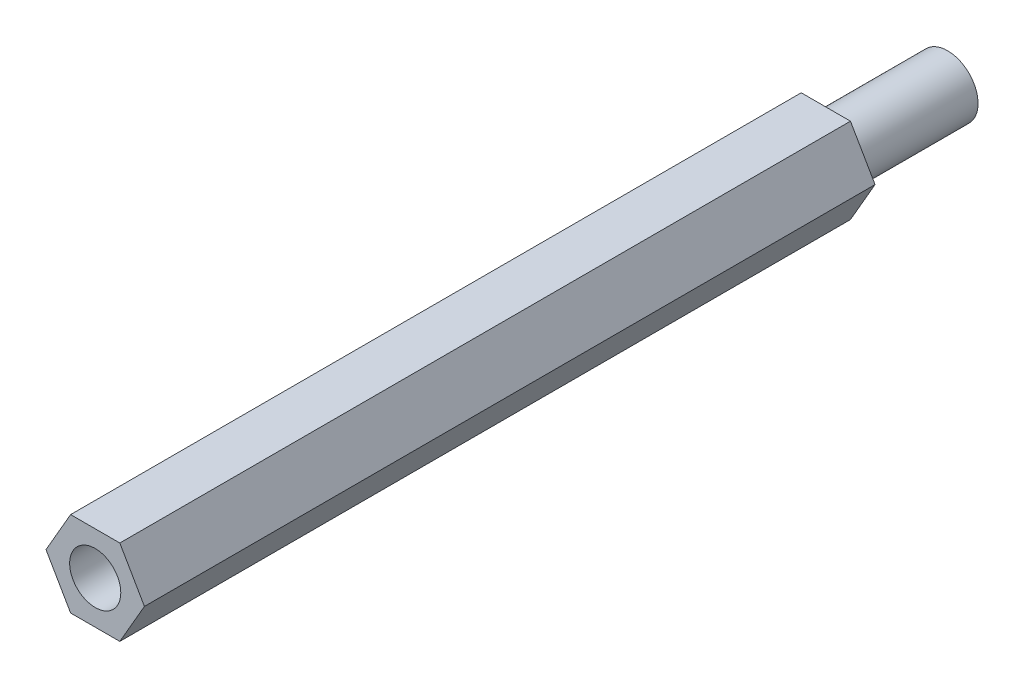
ISO-10303-21;
HEADER;
FILE_DESCRIPTION(('STEP AP214'),'2;1');
FILE_NAME('part.step','',(''),(''),'','','');
FILE_SCHEMA(('AUTOMOTIVE_DESIGN { 1 0 10303 214 1 1 1 1 }'));
ENDSEC;
DATA;
#1=APPLICATION_CONTEXT('core data for automotive mechanical design processes');
#2=APPLICATION_PROTOCOL_DEFINITION('international standard','automotive_design',2000,#1);
#3=PRODUCT_CONTEXT('',#1,'mechanical');
#4=PRODUCT('Part','Part','',(#3));
#5=PRODUCT_RELATED_PRODUCT_CATEGORY('part','',(#4));
#6=PRODUCT_DEFINITION_FORMATION('','',#4);
#7=PRODUCT_DEFINITION_CONTEXT('part definition',#1,'design');
#8=PRODUCT_DEFINITION('design','',#6,#7);
#9=PRODUCT_DEFINITION_SHAPE('','',#8);
#10=(LENGTH_UNIT() NAMED_UNIT(*) SI_UNIT(.MILLI.,.METRE.));
#11=(NAMED_UNIT(*) PLANE_ANGLE_UNIT() SI_UNIT($,.RADIAN.));
#12=(NAMED_UNIT(*) SI_UNIT($,.STERADIAN.) SOLID_ANGLE_UNIT());
#13=UNCERTAINTY_MEASURE_WITH_UNIT(LENGTH_MEASURE(1.E-05),#10,'distance_accuracy_value','');
#14=(GEOMETRIC_REPRESENTATION_CONTEXT(3) GLOBAL_UNCERTAINTY_ASSIGNED_CONTEXT((#13)) GLOBAL_UNIT_ASSIGNED_CONTEXT((#10,
#11,#12)) REPRESENTATION_CONTEXT('',''));
#15=CARTESIAN_POINT('',(0.,0.,0.));
#16=DIRECTION('',(0.,0.,1.));
#17=DIRECTION('',(1.,0.,0.));
#18=AXIS2_PLACEMENT_3D('',#15,#16,#17);
#19=CARTESIAN_POINT('',(2.02072594216369,3.5,60.));
#20=DIRECTION('',(0.,-1.,0.));
#21=DIRECTION('',(1.,0.,0.));
#22=AXIS2_PLACEMENT_3D('',#19,#20,#21);
#23=PLANE('',#22);
#24=DIRECTION('',(-1.,0.,0.));
#25=VECTOR('',#24,1.);
#26=CARTESIAN_POINT('',(2.02072594216369,3.5,0.));
#27=LINE('',#26,#25);
#28=CARTESIAN_POINT('',(2.02072594216369,3.5,0.));
#29=VERTEX_POINT('',#28);
#30=CARTESIAN_POINT('',(-2.02072594216369,3.5,0.));
#31=VERTEX_POINT('',#30);
#32=EDGE_CURVE('E126',#29,#31,#27,.T.);
#33=ORIENTED_EDGE('',*,*,#32,.T.);
#34=DIRECTION('',(0.,0.,-1.));
#35=VECTOR('',#34,1.);
#36=CARTESIAN_POINT('',(-2.02072594216369,3.5,60.));
#37=LINE('',#36,#35);
#38=CARTESIAN_POINT('',(-2.02072594216369,3.5,60.));
#39=VERTEX_POINT('',#38);
#40=EDGE_CURVE('E41',#39,#31,#37,.T.);
#41=ORIENTED_EDGE('',*,*,#40,.F.);
#42=DIRECTION('',(-1.,0.,0.));
#43=VECTOR('',#42,1.);
#44=CARTESIAN_POINT('',(2.02072594216369,3.5,60.));
#45=LINE('',#44,#43);
#46=CARTESIAN_POINT('',(2.02072594216369,3.5,60.));
#47=VERTEX_POINT('',#46);
#48=EDGE_CURVE('E137',#47,#39,#45,.T.);
#49=ORIENTED_EDGE('',*,*,#48,.F.);
#50=DIRECTION('',(0.,0.,-1.));
#51=VECTOR('',#50,1.);
#52=CARTESIAN_POINT('',(2.02072594216369,3.5,60.));
#53=LINE('',#52,#51);
#54=EDGE_CURVE('E122',#47,#29,#53,.T.);
#55=ORIENTED_EDGE('',*,*,#54,.T.);
#56=EDGE_LOOP('',(#33,#41,#49,#55));
#57=FACE_BOUND('',#56,.T.);
#58=ADVANCED_FACE('F38',(#57),#23,.F.);
#59=CARTESIAN_POINT('',(-2.02072594216369,3.5,60.));
#60=DIRECTION('',(0.866025403784439,-0.5,0.));
#61=DIRECTION('',(0.5,0.866025403784439,0.));
#62=AXIS2_PLACEMENT_3D('',#59,#60,#61);
#63=PLANE('',#62);
#64=DIRECTION('',(-0.5,-0.866025403784439,0.));
#65=VECTOR('',#64,1.);
#66=CARTESIAN_POINT('',(-2.02072594216369,3.5,0.));
#67=LINE('',#66,#65);
#68=CARTESIAN_POINT('',(-4.04145188432738,0.,0.));
#69=VERTEX_POINT('',#68);
#70=EDGE_CURVE('E129',#31,#69,#67,.T.);
#71=ORIENTED_EDGE('',*,*,#70,.T.);
#72=DIRECTION('',(0.,0.,-1.));
#73=VECTOR('',#72,1.);
#74=CARTESIAN_POINT('',(-4.04145188432738,0.,60.));
#75=LINE('',#74,#73);
#76=CARTESIAN_POINT('',(-4.04145188432738,0.,60.));
#77=VERTEX_POINT('',#76);
#78=EDGE_CURVE('E140',#77,#69,#75,.T.);
#79=ORIENTED_EDGE('',*,*,#78,.F.);
#80=DIRECTION('',(-0.5,-0.866025403784439,0.));
#81=VECTOR('',#80,1.);
#82=CARTESIAN_POINT('',(-2.02072594216369,3.5,60.));
#83=LINE('',#82,#81);
#84=EDGE_CURVE('E94',#39,#77,#83,.T.);
#85=ORIENTED_EDGE('',*,*,#84,.F.);
#86=ORIENTED_EDGE('',*,*,#40,.T.);
#87=EDGE_LOOP('',(#71,#79,#85,#86));
#88=FACE_BOUND('',#87,.T.);
#89=ADVANCED_FACE('F145',(#88),#63,.F.);
#90=CARTESIAN_POINT('',(-4.04145188432738,0.,60.));
#91=DIRECTION('',(0.866025403784438,0.5,0.));
#92=DIRECTION('',(-0.5,0.866025403784439,0.));
#93=AXIS2_PLACEMENT_3D('',#90,#91,#92);
#94=PLANE('',#93);
#95=DIRECTION('',(0.5,-0.866025403784439,0.));
#96=VECTOR('',#95,1.);
#97=CARTESIAN_POINT('',(-4.04145188432738,0.,0.));
#98=LINE('',#97,#96);
#99=CARTESIAN_POINT('',(-2.02072594216369,-3.5,0.));
#100=VERTEX_POINT('',#99);
#101=EDGE_CURVE('E132',#69,#100,#98,.T.);
#102=ORIENTED_EDGE('',*,*,#101,.T.);
#103=DIRECTION('',(0.,0.,-1.));
#104=VECTOR('',#103,1.);
#105=CARTESIAN_POINT('',(-2.02072594216369,-3.5,60.));
#106=LINE('',#105,#104);
#107=CARTESIAN_POINT('',(-2.02072594216369,-3.5,60.));
#108=VERTEX_POINT('',#107);
#109=EDGE_CURVE('E117',#108,#100,#106,.T.);
#110=ORIENTED_EDGE('',*,*,#109,.F.);
#111=DIRECTION('',(0.5,-0.866025403784439,0.));
#112=VECTOR('',#111,1.);
#113=CARTESIAN_POINT('',(-4.04145188432738,0.,60.));
#114=LINE('',#113,#112);
#115=EDGE_CURVE('E108',#77,#108,#114,.T.);
#116=ORIENTED_EDGE('',*,*,#115,.F.);
#117=ORIENTED_EDGE('',*,*,#78,.T.);
#118=EDGE_LOOP('',(#102,#110,#116,#117));
#119=FACE_BOUND('',#118,.T.);
#120=ADVANCED_FACE('F151',(#119),#94,.F.);
#121=CARTESIAN_POINT('',(-2.02072594216369,-3.5,60.));
#122=DIRECTION('',(0.,1.,0.));
#123=DIRECTION('',(-1.,0.,0.));
#124=AXIS2_PLACEMENT_3D('',#121,#122,#123);
#125=PLANE('',#124);
#126=DIRECTION('',(1.,0.,0.));
#127=VECTOR('',#126,1.);
#128=CARTESIAN_POINT('',(-2.02072594216369,-3.5,0.));
#129=LINE('',#128,#127);
#130=CARTESIAN_POINT('',(2.02072594216369,-3.5,0.));
#131=VERTEX_POINT('',#130);
#132=EDGE_CURVE('E116',#100,#131,#129,.T.);
#133=ORIENTED_EDGE('',*,*,#132,.T.);
#134=DIRECTION('',(0.,0.,-1.));
#135=VECTOR('',#134,1.);
#136=CARTESIAN_POINT('',(2.02072594216369,-3.5,60.));
#137=LINE('',#136,#135);
#138=CARTESIAN_POINT('',(2.02072594216369,-3.5,60.));
#139=VERTEX_POINT('',#138);
#140=EDGE_CURVE('E113',#139,#131,#137,.T.);
#141=ORIENTED_EDGE('',*,*,#140,.F.);
#142=DIRECTION('',(1.,0.,0.));
#143=VECTOR('',#142,1.);
#144=CARTESIAN_POINT('',(-2.02072594216369,-3.5,60.));
#145=LINE('',#144,#143);
#146=EDGE_CURVE('E102',#108,#139,#145,.T.);
#147=ORIENTED_EDGE('',*,*,#146,.F.);
#148=ORIENTED_EDGE('',*,*,#109,.T.);
#149=EDGE_LOOP('',(#133,#141,#147,#148));
#150=FACE_BOUND('',#149,.T.);
#151=ADVANCED_FACE('F114',(#150),#125,.F.);
#152=CARTESIAN_POINT('',(2.02072594216369,-3.5,60.));
#153=DIRECTION('',(-0.866025403784439,0.5,0.));
#154=DIRECTION('',(-0.5,-0.866025403784439,0.));
#155=AXIS2_PLACEMENT_3D('',#152,#153,#154);
#156=PLANE('',#155);
#157=DIRECTION('',(0.5,0.866025403784439,0.));
#158=VECTOR('',#157,1.);
#159=CARTESIAN_POINT('',(2.02072594216369,-3.5,0.));
#160=LINE('',#159,#158);
#161=CARTESIAN_POINT('',(4.04145188432738,0.,0.));
#162=VERTEX_POINT('',#161);
#163=EDGE_CURVE('E79',#131,#162,#160,.T.);
#164=ORIENTED_EDGE('',*,*,#163,.T.);
#165=DIRECTION('',(0.,0.,-1.));
#166=VECTOR('',#165,1.);
#167=CARTESIAN_POINT('',(4.04145188432738,0.,60.));
#168=LINE('',#167,#166);
#169=CARTESIAN_POINT('',(4.04145188432738,0.,60.));
#170=VERTEX_POINT('',#169);
#171=EDGE_CURVE('E118',#170,#162,#168,.T.);
#172=ORIENTED_EDGE('',*,*,#171,.F.);
#173=DIRECTION('',(0.5,0.866025403784439,0.));
#174=VECTOR('',#173,1.);
#175=CARTESIAN_POINT('',(2.02072594216369,-3.5,60.));
#176=LINE('',#175,#174);
#177=EDGE_CURVE('E106',#139,#170,#176,.T.);
#178=ORIENTED_EDGE('',*,*,#177,.F.);
#179=ORIENTED_EDGE('',*,*,#140,.T.);
#180=EDGE_LOOP('',(#164,#172,#178,#179));
#181=FACE_BOUND('',#180,.T.);
#182=ADVANCED_FACE('F120',(#181),#156,.F.);
#183=CARTESIAN_POINT('',(4.04145188432738,0.,60.));
#184=DIRECTION('',(-0.866025403784439,-0.5,0.));
#185=DIRECTION('',(0.5,-0.866025403784439,0.));
#186=AXIS2_PLACEMENT_3D('',#183,#184,#185);
#187=PLANE('',#186);
#188=DIRECTION('',(-0.5,0.866025403784438,0.));
#189=VECTOR('',#188,1.);
#190=CARTESIAN_POINT('',(4.04145188432738,0.,0.));
#191=LINE('',#190,#189);
#192=EDGE_CURVE('E85',#162,#29,#191,.T.);
#193=ORIENTED_EDGE('',*,*,#192,.T.);
#194=ORIENTED_EDGE('',*,*,#54,.F.);
#195=DIRECTION('',(-0.5,0.866025403784438,0.));
#196=VECTOR('',#195,1.);
#197=CARTESIAN_POINT('',(4.04145188432738,0.,60.));
#198=LINE('',#197,#196);
#199=EDGE_CURVE('E55',#170,#47,#198,.T.);
#200=ORIENTED_EDGE('',*,*,#199,.F.);
#201=ORIENTED_EDGE('',*,*,#171,.T.);
#202=EDGE_LOOP('',(#193,#194,#200,#201));
#203=FACE_BOUND('',#202,.T.);
#204=ADVANCED_FACE('F167',(#203),#187,.F.);
#205=CARTESIAN_POINT('',(0.,0.,60.));
#206=DIRECTION('',(0.,0.,1.));
#207=DIRECTION('',(1.,0.,0.));
#208=AXIS2_PLACEMENT_3D('',#205,#206,#207);
#209=PLANE('',#208);
#210=CARTESIAN_POINT('',(0.,0.,60.));
#211=DIRECTION('',(0.,0.,1.));
#212=DIRECTION('',(1.,0.,0.));
#213=AXIS2_PLACEMENT_3D('',#210,#211,#212);
#214=CIRCLE('',#213,2.1);
#215=CARTESIAN_POINT('',(2.1,0.,60.));
#216=VERTEX_POINT('',#215);
#217=EDGE_CURVE('E160',#216,#216,#214,.T.);
#218=ORIENTED_EDGE('',*,*,#217,.F.);
#219=EDGE_LOOP('',(#218));
#220=FACE_BOUND('',#219,.T.);
#221=ORIENTED_EDGE('',*,*,#48,.T.);
#222=ORIENTED_EDGE('',*,*,#84,.T.);
#223=ORIENTED_EDGE('',*,*,#115,.T.);
#224=ORIENTED_EDGE('',*,*,#146,.T.);
#225=ORIENTED_EDGE('',*,*,#177,.T.);
#226=ORIENTED_EDGE('',*,*,#199,.T.);
#227=EDGE_LOOP('',(#221,#222,#223,#224,#225,#226));
#228=FACE_BOUND('',#227,.T.);
#229=ADVANCED_FACE('F104',(#220,#228),#209,.T.);
#230=CARTESIAN_POINT('',(0.,0.,0.));
#231=DIRECTION('',(0.,0.,1.));
#232=DIRECTION('',(1.,0.,0.));
#233=AXIS2_PLACEMENT_3D('',#230,#231,#232);
#234=PLANE('',#233);
#235=CARTESIAN_POINT('',(0.,0.,0.));
#236=DIRECTION('',(0.,0.,-1.));
#237=DIRECTION('',(-1.,0.,0.));
#238=AXIS2_PLACEMENT_3D('',#235,#236,#237);
#239=CIRCLE('',#238,2.5);
#240=CARTESIAN_POINT('',(-2.5,0.,0.));
#241=VERTEX_POINT('',#240);
#242=EDGE_CURVE('E11',#241,#241,#239,.T.);
#243=ORIENTED_EDGE('',*,*,#242,.F.);
#244=EDGE_LOOP('',(#243));
#245=FACE_BOUND('',#244,.T.);
#246=ORIENTED_EDGE('',*,*,#32,.F.);
#247=ORIENTED_EDGE('',*,*,#192,.F.);
#248=ORIENTED_EDGE('',*,*,#163,.F.);
#249=ORIENTED_EDGE('',*,*,#132,.F.);
#250=ORIENTED_EDGE('',*,*,#101,.F.);
#251=ORIENTED_EDGE('',*,*,#70,.F.);
#252=EDGE_LOOP('',(#246,#247,#248,#249,#250,#251));
#253=FACE_BOUND('',#252,.T.);
#254=ADVANCED_FACE('F150',(#245,#253),#234,.F.);
#255=CARTESIAN_POINT('',(0.,0.,-10.));
#256=DIRECTION('',(0.,0.,1.));
#257=DIRECTION('',(1.,0.,0.));
#258=AXIS2_PLACEMENT_3D('',#255,#256,#257);
#259=CYLINDRICAL_SURFACE('',#258,2.5);
#260=CARTESIAN_POINT('',(0.,0.,-10.));
#261=DIRECTION('',(0.,0.,-1.));
#262=DIRECTION('',(-1.,0.,0.));
#263=AXIS2_PLACEMENT_3D('',#260,#261,#262);
#264=CIRCLE('',#263,2.5);
#265=CARTESIAN_POINT('',(-2.5,0.,-10.));
#266=VERTEX_POINT('',#265);
#267=EDGE_CURVE('E130',#266,#266,#264,.T.);
#268=ORIENTED_EDGE('',*,*,#267,.F.);
#269=EDGE_LOOP('',(#268));
#270=FACE_BOUND('',#269,.T.);
#271=ORIENTED_EDGE('',*,*,#242,.T.);
#272=EDGE_LOOP('',(#271));
#273=FACE_BOUND('',#272,.T.);
#274=ADVANCED_FACE('F173',(#270,#273),#259,.T.);
#275=CARTESIAN_POINT('',(0.,0.,-10.));
#276=DIRECTION('',(0.,0.,-1.));
#277=DIRECTION('',(-1.,0.,0.));
#278=AXIS2_PLACEMENT_3D('',#275,#276,#277);
#279=PLANE('',#278);
#280=ORIENTED_EDGE('',*,*,#267,.T.);
#281=EDGE_LOOP('',(#280));
#282=FACE_BOUND('',#281,.T.);
#283=ADVANCED_FACE('F214',(#282),#279,.T.);
#284=CARTESIAN_POINT('',(0.,0.,47.6));
#285=DIRECTION('',(0.,0.,1.));
#286=DIRECTION('',(1.,0.,0.));
#287=AXIS2_PLACEMENT_3D('',#284,#285,#286);
#288=CONICAL_SURFACE('',#287,2.1,1.02974425867665);
#289=CARTESIAN_POINT('',(0.,0.,46.3381927000421));
#290=VERTEX_POINT('',#289);
#291=VERTEX_LOOP('',#290);
#292=FACE_BOUND('',#291,.T.);
#293=CARTESIAN_POINT('',(0.,0.,47.6));
#294=DIRECTION('',(0.,0.,1.));
#295=DIRECTION('',(1.,0.,0.));
#296=AXIS2_PLACEMENT_3D('',#293,#294,#295);
#297=CIRCLE('',#296,2.1);
#298=CARTESIAN_POINT('',(2.1,0.,47.6));
#299=VERTEX_POINT('',#298);
#300=EDGE_CURVE('E157',#299,#299,#297,.T.);
#301=ORIENTED_EDGE('',*,*,#300,.T.);
#302=EDGE_LOOP('',(#301));
#303=FACE_BOUND('',#302,.T.);
#304=ADVANCED_FACE('F222',(#292,#303),#288,.F.);
#305=CARTESIAN_POINT('',(0.,0.,60.));
#306=DIRECTION('',(0.,0.,1.));
#307=DIRECTION('',(1.,0.,0.));
#308=AXIS2_PLACEMENT_3D('',#305,#306,#307);
#309=CYLINDRICAL_SURFACE('',#308,2.1);
#310=ORIENTED_EDGE('',*,*,#300,.F.);
#311=EDGE_LOOP('',(#310));
#312=FACE_BOUND('',#311,.T.);
#313=ORIENTED_EDGE('',*,*,#217,.T.);
#314=EDGE_LOOP('',(#313));
#315=FACE_BOUND('',#314,.T.);
#316=ADVANCED_FACE('F164',(#312,#315),#309,.F.);
#317=CLOSED_SHELL('',(#58,#89,#120,#151,#182,#204,#229,#254,#274,#283,#304,#316));
#318=MANIFOLD_SOLID_BREP('B2',#317);
#319=ADVANCED_BREP_SHAPE_REPRESENTATION('',(#18,#318),#14);
#320=SHAPE_DEFINITION_REPRESENTATION(#9,#319);
ENDSEC;
END-ISO-10303-21;
